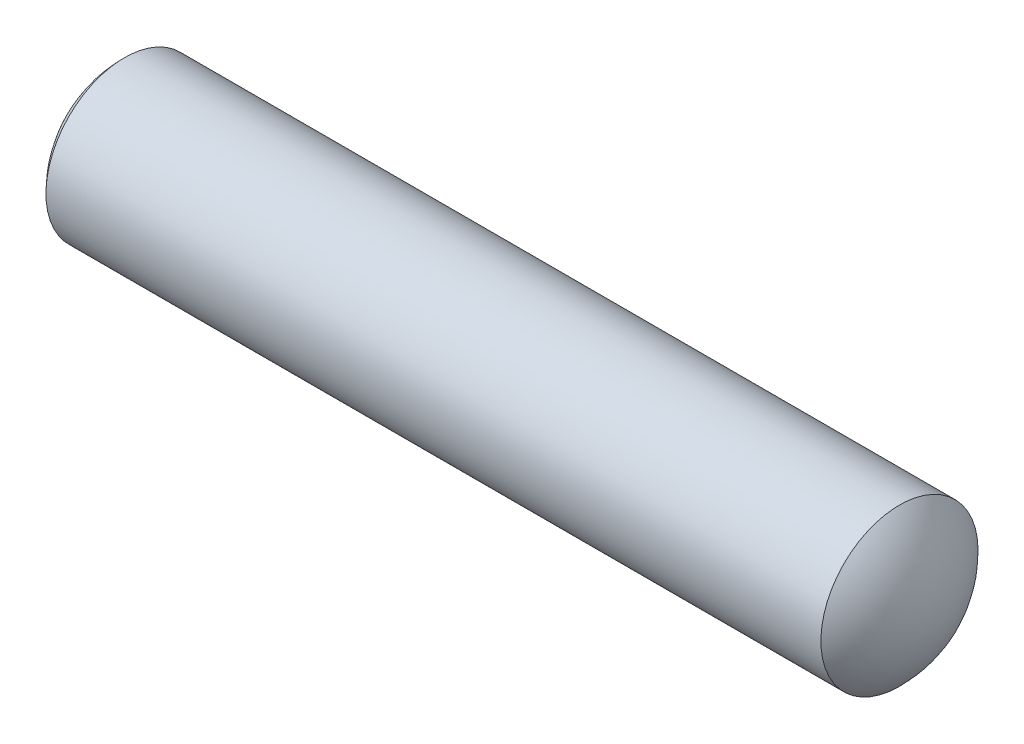
ISO-10303-21;
HEADER;
FILE_DESCRIPTION(('STEP AP214'),'2;1');
FILE_NAME('part.step','',(''),(''),'','','');
FILE_SCHEMA(('AUTOMOTIVE_DESIGN { 1 0 10303 214 1 1 1 1 }'));
ENDSEC;
DATA;
#1=APPLICATION_CONTEXT('core data for automotive mechanical design processes');
#2=APPLICATION_PROTOCOL_DEFINITION('international standard','automotive_design',2000,#1);
#3=PRODUCT_CONTEXT('',#1,'mechanical');
#4=PRODUCT('Part','Part','',(#3));
#5=PRODUCT_RELATED_PRODUCT_CATEGORY('part','',(#4));
#6=PRODUCT_DEFINITION_FORMATION('','',#4);
#7=PRODUCT_DEFINITION_CONTEXT('part definition',#1,'design');
#8=PRODUCT_DEFINITION('design','',#6,#7);
#9=PRODUCT_DEFINITION_SHAPE('','',#8);
#10=(LENGTH_UNIT() NAMED_UNIT(*) SI_UNIT(.MILLI.,.METRE.));
#11=(NAMED_UNIT(*) PLANE_ANGLE_UNIT() SI_UNIT($,.RADIAN.));
#12=(NAMED_UNIT(*) SI_UNIT($,.STERADIAN.) SOLID_ANGLE_UNIT());
#13=UNCERTAINTY_MEASURE_WITH_UNIT(LENGTH_MEASURE(1.E-05),#10,'distance_accuracy_value','');
#14=(GEOMETRIC_REPRESENTATION_CONTEXT(3) GLOBAL_UNCERTAINTY_ASSIGNED_CONTEXT((#13)) GLOBAL_UNIT_ASSIGNED_CONTEXT((#10,
#11,#12)) REPRESENTATION_CONTEXT('',''));
#15=CARTESIAN_POINT('',(0.,0.,0.));
#16=DIRECTION('',(0.,0.,1.));
#17=DIRECTION('',(1.,0.,0.));
#18=AXIS2_PLACEMENT_3D('',#15,#16,#17);
#19=CARTESIAN_POINT('',(15.1875,13.9567193922089,16.1069128034251));
#20=DIRECTION('',(0.,-0.755749574354258,0.654860733945285));
#21=DIRECTION('',(1.,0.,0.));
#22=AXIS2_PLACEMENT_3D('',#19,#20,#21);
#23=SPHERICAL_SURFACE('',#22,1.8375);
#24=CARTESIAN_POINT('',(15.1875,13.9567193922089,16.1069128034251));
#25=DIRECTION('',(-1.,0.,0.));
#26=DIRECTION('',(0.,-0.654860733945285,-0.755749574354258));
#27=AXIS2_PLACEMENT_3D('',#24,#25,#26);
#28=SPHERICAL_SURFACE('',#27,1.8375);
#29=CARTESIAN_POINT('',(16.4734821149612,13.9567193922089,16.1069128034251));
#30=DIRECTION('',(-1.,0.,0.));
#31=DIRECTION('',(0.,-0.654860733945285,-0.755749574354258));
#32=AXIS2_PLACEMENT_3D('',#29,#30,#31);
#33=CIRCLE('',#32,1.3125);
#34=CARTESIAN_POINT('',(16.4734821149612,13.0972146789057,15.1149914870851));
#35=VERTEX_POINT('',#34);
#36=EDGE_CURVE('E11',#35,#35,#33,.T.);
#37=ORIENTED_EDGE('',*,*,#36,.F.);
#38=EDGE_LOOP('',(#37));
#39=FACE_BOUND('',#38,.T.);
#40=ADVANCED_FACE('F17',(#39),#28,.T.);
#41=CARTESIAN_POINT('',(10.,13.9567193922089,16.1069128034251));
#42=DIRECTION('',(-1.,0.,0.));
#43=DIRECTION('',(0.,-0.654860733945285,-0.755749574354258));
#44=AXIS2_PLACEMENT_3D('',#41,#42,#43);
#45=CYLINDRICAL_SURFACE('',#44,1.3125);
#46=CARTESIAN_POINT('',(3.52651788503884,13.9567193922089,16.1069128034251));
#47=DIRECTION('',(-1.,0.,0.));
#48=DIRECTION('',(0.,-0.654860733945285,-0.755749574354258));
#49=AXIS2_PLACEMENT_3D('',#46,#47,#48);
#50=CIRCLE('',#49,1.3125);
#51=CARTESIAN_POINT('',(3.52651788503884,13.0972146789057,15.1149914870851));
#52=VERTEX_POINT('',#51);
#53=EDGE_CURVE('E26',#52,#52,#50,.T.);
#54=ORIENTED_EDGE('',*,*,#53,.F.);
#55=EDGE_LOOP('',(#54));
#56=FACE_BOUND('',#55,.T.);
#57=ORIENTED_EDGE('',*,*,#36,.T.);
#58=EDGE_LOOP('',(#57));
#59=FACE_BOUND('',#58,.T.);
#60=ADVANCED_FACE('F51',(#56,#59),#45,.T.);
#61=CARTESIAN_POINT('',(4.8125,13.9567193922089,16.1069128034251));
#62=DIRECTION('',(0.,-0.755749574354258,0.654860733945285));
#63=DIRECTION('',(-1.,0.,0.));
#64=AXIS2_PLACEMENT_3D('',#61,#62,#63);
#65=SPHERICAL_SURFACE('',#64,1.8375);
#66=CARTESIAN_POINT('',(4.8125,13.9567193922089,16.1069128034251));
#67=DIRECTION('',(-1.,0.,0.));
#68=DIRECTION('',(0.,-0.654860733945285,-0.755749574354258));
#69=AXIS2_PLACEMENT_3D('',#66,#67,#68);
#70=SPHERICAL_SURFACE('',#69,1.8375);
#71=ORIENTED_EDGE('',*,*,#53,.T.);
#72=EDGE_LOOP('',(#71));
#73=FACE_BOUND('',#72,.T.);
#74=ADVANCED_FACE('F19',(#73),#70,.T.);
#75=CLOSED_SHELL('',(#40,#60,#74));
#76=MANIFOLD_SOLID_BREP('B1',#75);
#77=ADVANCED_BREP_SHAPE_REPRESENTATION('',(#18,#76),#14);
#78=SHAPE_DEFINITION_REPRESENTATION(#9,#77);
ENDSEC;
END-ISO-10303-21;
